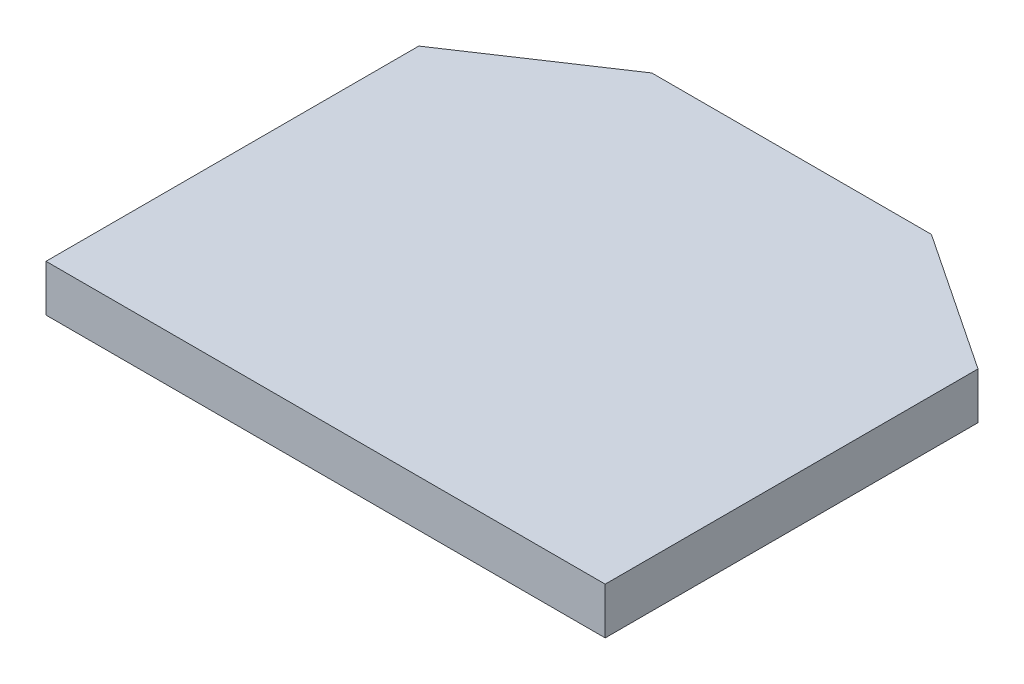
ISO-10303-21;
HEADER;
FILE_DESCRIPTION(('STEP AP214'),'2;1');
FILE_NAME('part.step','',(''),(''),'','','');
FILE_SCHEMA(('AUTOMOTIVE_DESIGN { 1 0 10303 214 1 1 1 1 }'));
ENDSEC;
DATA;
#1=APPLICATION_CONTEXT('core data for automotive mechanical design processes');
#2=APPLICATION_PROTOCOL_DEFINITION('international standard','automotive_design',2000,#1);
#3=PRODUCT_CONTEXT('',#1,'mechanical');
#4=PRODUCT('Part','Part','',(#3));
#5=PRODUCT_RELATED_PRODUCT_CATEGORY('part','',(#4));
#6=PRODUCT_DEFINITION_FORMATION('','',#4);
#7=PRODUCT_DEFINITION_CONTEXT('part definition',#1,'design');
#8=PRODUCT_DEFINITION('design','',#6,#7);
#9=PRODUCT_DEFINITION_SHAPE('','',#8);
#10=(LENGTH_UNIT() NAMED_UNIT(*) SI_UNIT(.MILLI.,.METRE.));
#11=(NAMED_UNIT(*) PLANE_ANGLE_UNIT() SI_UNIT($,.RADIAN.));
#12=(NAMED_UNIT(*) SI_UNIT($,.STERADIAN.) SOLID_ANGLE_UNIT());
#13=UNCERTAINTY_MEASURE_WITH_UNIT(LENGTH_MEASURE(1.E-05),#10,'distance_accuracy_value','');
#14=(GEOMETRIC_REPRESENTATION_CONTEXT(3) GLOBAL_UNCERTAINTY_ASSIGNED_CONTEXT((#13)) GLOBAL_UNIT_ASSIGNED_CONTEXT((#10,
#11,#12)) REPRESENTATION_CONTEXT('',''));
#15=CARTESIAN_POINT('',(0.,0.,0.));
#16=DIRECTION('',(0.,0.,1.));
#17=DIRECTION('',(1.,0.,0.));
#18=AXIS2_PLACEMENT_3D('',#15,#16,#17);
#19=CARTESIAN_POINT('',(-38.1,6.35,0.));
#20=DIRECTION('',(-1.,0.,0.));
#21=DIRECTION('',(0.,0.,1.));
#22=AXIS2_PLACEMENT_3D('',#19,#20,#21);
#23=PLANE('',#22);
#24=DIRECTION('',(0.,0.,-1.));
#25=VECTOR('',#24,1.);
#26=CARTESIAN_POINT('',(-38.1,0.,0.));
#27=LINE('',#26,#25);
#28=CARTESIAN_POINT('',(-38.1,0.,0.));
#29=VERTEX_POINT('',#28);
#30=CARTESIAN_POINT('',(-38.1,0.,-50.8));
#31=VERTEX_POINT('',#30);
#32=EDGE_CURVE('E120',#29,#31,#27,.T.);
#33=ORIENTED_EDGE('',*,*,#32,.F.);
#34=DIRECTION('',(0.,-1.,0.));
#35=VECTOR('',#34,1.);
#36=CARTESIAN_POINT('',(-38.1,6.35,0.));
#37=LINE('',#36,#35);
#38=CARTESIAN_POINT('',(-38.1,6.35,0.));
#39=VERTEX_POINT('',#38);
#40=EDGE_CURVE('E11',#39,#29,#37,.T.);
#41=ORIENTED_EDGE('',*,*,#40,.F.);
#42=DIRECTION('',(0.,0.,-1.));
#43=VECTOR('',#42,1.);
#44=CARTESIAN_POINT('',(-38.1,6.35,0.));
#45=LINE('',#44,#43);
#46=CARTESIAN_POINT('',(-38.1,6.35,-50.8));
#47=VERTEX_POINT('',#46);
#48=EDGE_CURVE('E132',#39,#47,#45,.T.);
#49=ORIENTED_EDGE('',*,*,#48,.T.);
#50=DIRECTION('',(0.,-1.,0.));
#51=VECTOR('',#50,1.);
#52=CARTESIAN_POINT('',(-38.1,6.35,-50.8));
#53=LINE('',#52,#51);
#54=EDGE_CURVE('E36',#47,#31,#53,.T.);
#55=ORIENTED_EDGE('',*,*,#54,.T.);
#56=EDGE_LOOP('',(#33,#41,#49,#55));
#57=FACE_BOUND('',#56,.T.);
#58=ADVANCED_FACE('F33',(#57),#23,.T.);
#59=CARTESIAN_POINT('',(-38.1,6.35,0.));
#60=DIRECTION('',(0.,0.,-1.));
#61=DIRECTION('',(-1.,0.,0.));
#62=AXIS2_PLACEMENT_3D('',#59,#60,#61);
#63=PLANE('',#62);
#64=DIRECTION('',(1.,0.,0.));
#65=VECTOR('',#64,1.);
#66=CARTESIAN_POINT('',(-38.1,0.,0.));
#67=LINE('',#66,#65);
#68=CARTESIAN_POINT('',(38.1,0.,0.));
#69=VERTEX_POINT('',#68);
#70=EDGE_CURVE('E72',#29,#69,#67,.T.);
#71=ORIENTED_EDGE('',*,*,#70,.T.);
#72=DIRECTION('',(0.,-1.,0.));
#73=VECTOR('',#72,1.);
#74=CARTESIAN_POINT('',(38.1,6.35,0.));
#75=LINE('',#74,#73);
#76=CARTESIAN_POINT('',(38.1,6.35,0.));
#77=VERTEX_POINT('',#76);
#78=EDGE_CURVE('E42',#77,#69,#75,.T.);
#79=ORIENTED_EDGE('',*,*,#78,.F.);
#80=DIRECTION('',(1.,0.,0.));
#81=VECTOR('',#80,1.);
#82=CARTESIAN_POINT('',(-38.1,6.35,0.));
#83=LINE('',#82,#81);
#84=EDGE_CURVE('E99',#39,#77,#83,.T.);
#85=ORIENTED_EDGE('',*,*,#84,.F.);
#86=ORIENTED_EDGE('',*,*,#40,.T.);
#87=EDGE_LOOP('',(#71,#79,#85,#86));
#88=FACE_BOUND('',#87,.T.);
#89=ADVANCED_FACE('F151',(#88),#63,.F.);
#90=CARTESIAN_POINT('',(38.1,6.35,0.));
#91=DIRECTION('',(-1.,0.,0.));
#92=DIRECTION('',(0.,0.,1.));
#93=AXIS2_PLACEMENT_3D('',#90,#91,#92);
#94=PLANE('',#93);
#95=DIRECTION('',(0.,0.,-1.));
#96=VECTOR('',#95,1.);
#97=CARTESIAN_POINT('',(38.1,0.,0.));
#98=LINE('',#97,#96);
#99=CARTESIAN_POINT('',(38.1,0.,-50.8));
#100=VERTEX_POINT('',#99);
#101=EDGE_CURVE('E106',#69,#100,#98,.T.);
#102=ORIENTED_EDGE('',*,*,#101,.T.);
#103=DIRECTION('',(0.,-1.,0.));
#104=VECTOR('',#103,1.);
#105=CARTESIAN_POINT('',(38.1,6.35,-50.8));
#106=LINE('',#105,#104);
#107=CARTESIAN_POINT('',(38.1,6.35,-50.8));
#108=VERTEX_POINT('',#107);
#109=EDGE_CURVE('E103',#108,#100,#106,.T.);
#110=ORIENTED_EDGE('',*,*,#109,.F.);
#111=DIRECTION('',(0.,0.,-1.));
#112=VECTOR('',#111,1.);
#113=CARTESIAN_POINT('',(38.1,6.35,0.));
#114=LINE('',#113,#112);
#115=EDGE_CURVE('E91',#77,#108,#114,.T.);
#116=ORIENTED_EDGE('',*,*,#115,.F.);
#117=ORIENTED_EDGE('',*,*,#78,.T.);
#118=EDGE_LOOP('',(#102,#110,#116,#117));
#119=FACE_BOUND('',#118,.T.);
#120=ADVANCED_FACE('F104',(#119),#94,.F.);
#121=CARTESIAN_POINT('',(19.05,6.35,-63.5));
#122=DIRECTION('',(0.554700196225229,0.,-0.832050294337843));
#123=DIRECTION('',(-0.832050294337843,0.,-0.554700196225229));
#124=AXIS2_PLACEMENT_3D('',#121,#122,#123);
#125=PLANE('',#124);
#126=DIRECTION('',(0.832050294337843,0.,0.554700196225229));
#127=VECTOR('',#126,1.);
#128=CARTESIAN_POINT('',(19.05,0.,-63.5));
#129=LINE('',#128,#127);
#130=CARTESIAN_POINT('',(19.05,0.,-63.5));
#131=VERTEX_POINT('',#130);
#132=EDGE_CURVE('E129',#131,#100,#129,.T.);
#133=ORIENTED_EDGE('',*,*,#132,.F.);
#134=DIRECTION('',(0.,-1.,0.));
#135=VECTOR('',#134,1.);
#136=CARTESIAN_POINT('',(19.05,6.35,-63.5));
#137=LINE('',#136,#135);
#138=CARTESIAN_POINT('',(19.05,6.35,-63.5));
#139=VERTEX_POINT('',#138);
#140=EDGE_CURVE('E110',#139,#131,#137,.T.);
#141=ORIENTED_EDGE('',*,*,#140,.F.);
#142=DIRECTION('',(0.832050294337843,0.,0.554700196225229));
#143=VECTOR('',#142,1.);
#144=CARTESIAN_POINT('',(19.05,6.35,-63.5));
#145=LINE('',#144,#143);
#146=EDGE_CURVE('E97',#139,#108,#145,.T.);
#147=ORIENTED_EDGE('',*,*,#146,.T.);
#148=ORIENTED_EDGE('',*,*,#109,.T.);
#149=EDGE_LOOP('',(#133,#141,#147,#148));
#150=FACE_BOUND('',#149,.T.);
#151=ADVANCED_FACE('F112',(#150),#125,.T.);
#152=CARTESIAN_POINT('',(-19.05,6.35,-63.5));
#153=DIRECTION('',(0.,0.,-1.));
#154=DIRECTION('',(-1.,0.,0.));
#155=AXIS2_PLACEMENT_3D('',#152,#153,#154);
#156=PLANE('',#155);
#157=DIRECTION('',(1.,0.,0.));
#158=VECTOR('',#157,1.);
#159=CARTESIAN_POINT('',(-19.05,0.,-63.5));
#160=LINE('',#159,#158);
#161=CARTESIAN_POINT('',(-19.05,0.,-63.5));
#162=VERTEX_POINT('',#161);
#163=EDGE_CURVE('E126',#162,#131,#160,.T.);
#164=ORIENTED_EDGE('',*,*,#163,.F.);
#165=DIRECTION('',(0.,-1.,0.));
#166=VECTOR('',#165,1.);
#167=CARTESIAN_POINT('',(-19.05,6.35,-63.5));
#168=LINE('',#167,#166);
#169=CARTESIAN_POINT('',(-19.05,6.35,-63.5));
#170=VERTEX_POINT('',#169);
#171=EDGE_CURVE('E135',#170,#162,#168,.T.);
#172=ORIENTED_EDGE('',*,*,#171,.F.);
#173=DIRECTION('',(1.,0.,0.));
#174=VECTOR('',#173,1.);
#175=CARTESIAN_POINT('',(-19.05,6.35,-63.5));
#176=LINE('',#175,#174);
#177=EDGE_CURVE('E113',#170,#139,#176,.T.);
#178=ORIENTED_EDGE('',*,*,#177,.T.);
#179=ORIENTED_EDGE('',*,*,#140,.T.);
#180=EDGE_LOOP('',(#164,#172,#178,#179));
#181=FACE_BOUND('',#180,.T.);
#182=ADVANCED_FACE('F141',(#181),#156,.T.);
#183=CARTESIAN_POINT('',(-38.1,6.35,-50.8));
#184=DIRECTION('',(-0.554700196225229,0.,-0.832050294337844));
#185=DIRECTION('',(-0.832050294337844,0.,0.554700196225229));
#186=AXIS2_PLACEMENT_3D('',#183,#184,#185);
#187=PLANE('',#186);
#188=DIRECTION('',(0.832050294337844,0.,-0.554700196225229));
#189=VECTOR('',#188,1.);
#190=CARTESIAN_POINT('',(-38.1,0.,-50.8));
#191=LINE('',#190,#189);
#192=EDGE_CURVE('E123',#31,#162,#191,.T.);
#193=ORIENTED_EDGE('',*,*,#192,.F.);
#194=ORIENTED_EDGE('',*,*,#54,.F.);
#195=DIRECTION('',(0.832050294337844,0.,-0.554700196225229));
#196=VECTOR('',#195,1.);
#197=CARTESIAN_POINT('',(-38.1,6.35,-50.8));
#198=LINE('',#197,#196);
#199=EDGE_CURVE('E115',#47,#170,#198,.T.);
#200=ORIENTED_EDGE('',*,*,#199,.T.);
#201=ORIENTED_EDGE('',*,*,#171,.T.);
#202=EDGE_LOOP('',(#193,#194,#200,#201));
#203=FACE_BOUND('',#202,.T.);
#204=ADVANCED_FACE('F137',(#203),#187,.T.);
#205=CARTESIAN_POINT('',(0.,6.35,0.));
#206=DIRECTION('',(0.,-1.,0.));
#207=DIRECTION('',(0.,0.,-1.));
#208=AXIS2_PLACEMENT_3D('',#205,#206,#207);
#209=PLANE('',#208);
#210=ORIENTED_EDGE('',*,*,#48,.F.);
#211=ORIENTED_EDGE('',*,*,#84,.T.);
#212=ORIENTED_EDGE('',*,*,#115,.T.);
#213=ORIENTED_EDGE('',*,*,#146,.F.);
#214=ORIENTED_EDGE('',*,*,#177,.F.);
#215=ORIENTED_EDGE('',*,*,#199,.F.);
#216=EDGE_LOOP('',(#210,#211,#212,#213,#214,#215));
#217=FACE_BOUND('',#216,.T.);
#218=ADVANCED_FACE('F94',(#217),#209,.F.);
#219=CARTESIAN_POINT('',(0.,0.,0.));
#220=DIRECTION('',(0.,-1.,0.));
#221=DIRECTION('',(0.,0.,-1.));
#222=AXIS2_PLACEMENT_3D('',#219,#220,#221);
#223=PLANE('',#222);
#224=ORIENTED_EDGE('',*,*,#32,.T.);
#225=ORIENTED_EDGE('',*,*,#192,.T.);
#226=ORIENTED_EDGE('',*,*,#163,.T.);
#227=ORIENTED_EDGE('',*,*,#132,.T.);
#228=ORIENTED_EDGE('',*,*,#101,.F.);
#229=ORIENTED_EDGE('',*,*,#70,.F.);
#230=EDGE_LOOP('',(#224,#225,#226,#227,#228,#229));
#231=FACE_BOUND('',#230,.T.);
#232=ADVANCED_FACE('F139',(#231),#223,.T.);
#233=CLOSED_SHELL('',(#58,#89,#120,#151,#182,#204,#218,#232));
#234=MANIFOLD_SOLID_BREP('B2',#233);
#235=ADVANCED_BREP_SHAPE_REPRESENTATION('',(#18,#234),#14);
#236=SHAPE_DEFINITION_REPRESENTATION(#9,#235);
ENDSEC;
END-ISO-10303-21;
